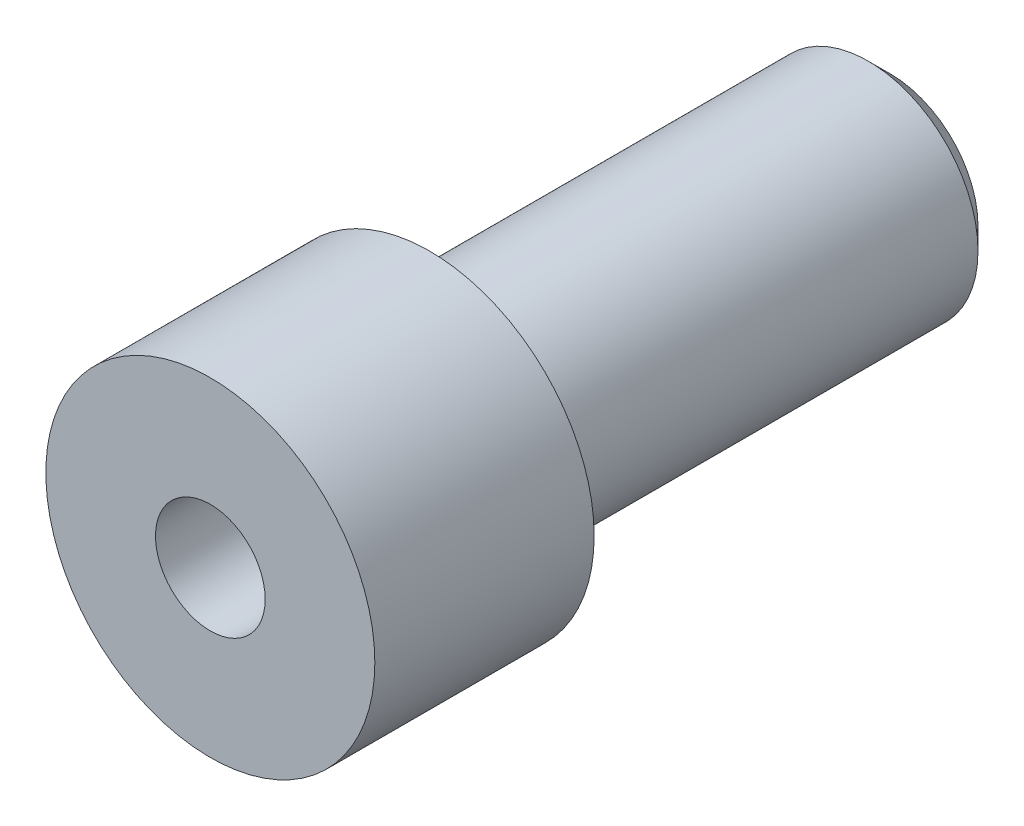
ISO-10303-21;
HEADER;
FILE_DESCRIPTION(('STEP AP214'),'2;1');
FILE_NAME('part.step','',(''),(''),'','','');
FILE_SCHEMA(('AUTOMOTIVE_DESIGN { 1 0 10303 214 1 1 1 1 }'));
ENDSEC;
DATA;
#1=APPLICATION_CONTEXT('core data for automotive mechanical design processes');
#2=APPLICATION_PROTOCOL_DEFINITION('international standard','automotive_design',2000,#1);
#3=PRODUCT_CONTEXT('',#1,'mechanical');
#4=PRODUCT('Part','Part','',(#3));
#5=PRODUCT_RELATED_PRODUCT_CATEGORY('part','',(#4));
#6=PRODUCT_DEFINITION_FORMATION('','',#4);
#7=PRODUCT_DEFINITION_CONTEXT('part definition',#1,'design');
#8=PRODUCT_DEFINITION('design','',#6,#7);
#9=PRODUCT_DEFINITION_SHAPE('','',#8);
#10=(LENGTH_UNIT() NAMED_UNIT(*) SI_UNIT(.MILLI.,.METRE.));
#11=(NAMED_UNIT(*) PLANE_ANGLE_UNIT() SI_UNIT($,.RADIAN.));
#12=(NAMED_UNIT(*) SI_UNIT($,.STERADIAN.) SOLID_ANGLE_UNIT());
#13=UNCERTAINTY_MEASURE_WITH_UNIT(LENGTH_MEASURE(1.E-05),#10,'distance_accuracy_value','');
#14=(GEOMETRIC_REPRESENTATION_CONTEXT(3) GLOBAL_UNCERTAINTY_ASSIGNED_CONTEXT((#13)) GLOBAL_UNIT_ASSIGNED_CONTEXT((#10,
#11,#12)) REPRESENTATION_CONTEXT('',''));
#15=CARTESIAN_POINT('',(0.,0.,0.));
#16=DIRECTION('',(0.,0.,1.));
#17=DIRECTION('',(1.,0.,0.));
#18=AXIS2_PLACEMENT_3D('',#15,#16,#17);
#19=CARTESIAN_POINT('',(0.,0.,2.));
#20=DIRECTION('',(0.,0.,-1.));
#21=DIRECTION('',(-1.,0.,0.));
#22=AXIS2_PLACEMENT_3D('',#19,#20,#21);
#23=CYLINDRICAL_SURFACE('',#22,1.5);
#24=CARTESIAN_POINT('',(0.,0.,2.));
#25=DIRECTION('',(0.,0.,1.));
#26=DIRECTION('',(1.,0.,0.));
#27=AXIS2_PLACEMENT_3D('',#24,#25,#26);
#28=CIRCLE('',#27,1.5);
#29=CARTESIAN_POINT('',(1.5,0.,2.));
#30=VERTEX_POINT('',#29);
#31=EDGE_CURVE('E60',#30,#30,#28,.T.);
#32=ORIENTED_EDGE('',*,*,#31,.F.);
#33=EDGE_LOOP('',(#32));
#34=FACE_BOUND('',#33,.T.);
#35=CARTESIAN_POINT('',(0.,0.,0.));
#36=DIRECTION('',(0.,0.,1.));
#37=DIRECTION('',(1.,0.,0.));
#38=AXIS2_PLACEMENT_3D('',#35,#36,#37);
#39=CIRCLE('',#38,1.5);
#40=CARTESIAN_POINT('',(1.5,0.,0.));
#41=VERTEX_POINT('',#40);
#42=EDGE_CURVE('E56',#41,#41,#39,.T.);
#43=ORIENTED_EDGE('',*,*,#42,.T.);
#44=EDGE_LOOP('',(#43));
#45=FACE_BOUND('',#44,.T.);
#46=ADVANCED_FACE('F36',(#34,#45),#23,.T.);
#47=CARTESIAN_POINT('',(0.,0.,2.));
#48=DIRECTION('',(0.,0.,1.));
#49=DIRECTION('',(1.,0.,0.));
#50=AXIS2_PLACEMENT_3D('',#47,#48,#49);
#51=PLANE('',#50);
#52=CARTESIAN_POINT('',(0.,0.,2.));
#53=DIRECTION('',(0.,0.,1.));
#54=DIRECTION('',(1.,0.,0.));
#55=AXIS2_PLACEMENT_3D('',#52,#53,#54);
#56=CIRCLE('',#55,0.49999999999999);
#57=CARTESIAN_POINT('',(0.49999999999999,0.,2.));
#58=VERTEX_POINT('',#57);
#59=EDGE_CURVE('E57',#58,#58,#56,.T.);
#60=ORIENTED_EDGE('',*,*,#59,.F.);
#61=EDGE_LOOP('',(#60));
#62=FACE_BOUND('',#61,.T.);
#63=ORIENTED_EDGE('',*,*,#31,.T.);
#64=EDGE_LOOP('',(#63));
#65=FACE_BOUND('',#64,.T.);
#66=ADVANCED_FACE('F83',(#62,#65),#51,.T.);
#67=CARTESIAN_POINT('',(0.,0.,0.));
#68=DIRECTION('',(0.,0.,1.));
#69=DIRECTION('',(1.,0.,0.));
#70=AXIS2_PLACEMENT_3D('',#67,#68,#69);
#71=PLANE('',#70);
#72=CARTESIAN_POINT('',(0.,0.,0.));
#73=DIRECTION('',(0.,0.,-1.));
#74=DIRECTION('',(-1.,0.,0.));
#75=AXIS2_PLACEMENT_3D('',#72,#73,#74);
#76=CIRCLE('',#75,1.);
#77=CARTESIAN_POINT('',(-1.,0.,0.));
#78=VERTEX_POINT('',#77);
#79=EDGE_CURVE('E65',#78,#78,#76,.T.);
#80=ORIENTED_EDGE('',*,*,#79,.F.);
#81=EDGE_LOOP('',(#80));
#82=FACE_BOUND('',#81,.T.);
#83=ORIENTED_EDGE('',*,*,#42,.F.);
#84=EDGE_LOOP('',(#83));
#85=FACE_BOUND('',#84,.T.);
#86=ADVANCED_FACE('F88',(#82,#85),#71,.F.);
#87=CARTESIAN_POINT('',(0.,0.,-4.2));
#88=DIRECTION('',(0.,0.,1.));
#89=DIRECTION('',(1.,0.,0.));
#90=AXIS2_PLACEMENT_3D('',#87,#88,#89);
#91=CYLINDRICAL_SURFACE('',#90,1.);
#92=CARTESIAN_POINT('',(0.,0.,-4.));
#93=DIRECTION('',(0.,0.,-1.));
#94=DIRECTION('',(-1.,0.,0.));
#95=AXIS2_PLACEMENT_3D('',#92,#93,#94);
#96=CIRCLE('',#95,1.);
#97=CARTESIAN_POINT('',(-1.,0.,-4.));
#98=VERTEX_POINT('',#97);
#99=EDGE_CURVE('E11',#98,#98,#96,.F.);
#100=ORIENTED_EDGE('',*,*,#99,.T.);
#101=EDGE_LOOP('',(#100));
#102=FACE_BOUND('',#101,.T.);
#103=ORIENTED_EDGE('',*,*,#79,.T.);
#104=EDGE_LOOP('',(#103));
#105=FACE_BOUND('',#104,.T.);
#106=ADVANCED_FACE('F79',(#102,#105),#91,.T.);
#107=CARTESIAN_POINT('',(0.,0.,-4.2));
#108=DIRECTION('',(0.,0.,-1.));
#109=DIRECTION('',(-1.,0.,0.));
#110=AXIS2_PLACEMENT_3D('',#107,#108,#109);
#111=PLANE('',#110);
#112=CARTESIAN_POINT('',(0.,0.,-4.2));
#113=DIRECTION('',(0.,0.,-1.));
#114=DIRECTION('',(-1.,0.,0.));
#115=AXIS2_PLACEMENT_3D('',#112,#113,#114);
#116=CIRCLE('',#115,0.800000000000001);
#117=CARTESIAN_POINT('',(-0.800000000000001,0.,-4.2));
#118=VERTEX_POINT('',#117);
#119=EDGE_CURVE('E44',#118,#118,#116,.T.);
#120=ORIENTED_EDGE('',*,*,#119,.T.);
#121=EDGE_LOOP('',(#120));
#122=FACE_BOUND('',#121,.T.);
#123=ADVANCED_FACE('F72',(#122),#111,.T.);
#124=CARTESIAN_POINT('',(0.,0.,-4.2));
#125=DIRECTION('',(0.,0.,1.));
#126=DIRECTION('',(1.,0.,0.));
#127=AXIS2_PLACEMENT_3D('',#124,#125,#126);
#128=CONICAL_SURFACE('',#127,0.800000000000001,0.785398163397448);
#129=ORIENTED_EDGE('',*,*,#99,.F.);
#130=EDGE_LOOP('',(#129));
#131=FACE_BOUND('',#130,.T.);
#132=ORIENTED_EDGE('',*,*,#119,.F.);
#133=EDGE_LOOP('',(#132));
#134=FACE_BOUND('',#133,.T.);
#135=ADVANCED_FACE('F39',(#131,#134),#128,.T.);
#136=CARTESIAN_POINT('',(0.,0.,-3.2));
#137=DIRECTION('',(0.,0.,1.));
#138=DIRECTION('',(1.,0.,0.));
#139=AXIS2_PLACEMENT_3D('',#136,#137,#138);
#140=CONICAL_SURFACE('',#139,0.499999999999997,1.02974425867665);
#141=CARTESIAN_POINT('',(0.,0.,-3.50043030951378));
#142=VERTEX_POINT('',#141);
#143=VERTEX_LOOP('',#142);
#144=FACE_BOUND('',#143,.T.);
#145=CARTESIAN_POINT('',(0.,0.,-3.2));
#146=DIRECTION('',(0.,0.,1.));
#147=DIRECTION('',(1.,0.,0.));
#148=AXIS2_PLACEMENT_3D('',#145,#146,#147);
#149=CIRCLE('',#148,0.499999999999997);
#150=CARTESIAN_POINT('',(0.499999999999997,0.,-3.2));
#151=VERTEX_POINT('',#150);
#152=EDGE_CURVE('E54',#151,#151,#149,.T.);
#153=ORIENTED_EDGE('',*,*,#152,.T.);
#154=EDGE_LOOP('',(#153));
#155=FACE_BOUND('',#154,.T.);
#156=ADVANCED_FACE('F47',(#144,#155),#140,.F.);
#157=CARTESIAN_POINT('',(0.,0.,2.));
#158=DIRECTION('',(0.,0.,1.));
#159=DIRECTION('',(1.,0.,0.));
#160=AXIS2_PLACEMENT_3D('',#157,#158,#159);
#161=CYLINDRICAL_SURFACE('',#160,0.499999999999994);
#162=ORIENTED_EDGE('',*,*,#152,.F.);
#163=EDGE_LOOP('',(#162));
#164=FACE_BOUND('',#163,.T.);
#165=ORIENTED_EDGE('',*,*,#59,.T.);
#166=EDGE_LOOP('',(#165));
#167=FACE_BOUND('',#166,.T.);
#168=ADVANCED_FACE('F50',(#164,#167),#161,.F.);
#169=CLOSED_SHELL('',(#46,#66,#86,#106,#123,#135,#156,#168));
#170=MANIFOLD_SOLID_BREP('B2',#169);
#171=ADVANCED_BREP_SHAPE_REPRESENTATION('',(#18,#170),#14);
#172=SHAPE_DEFINITION_REPRESENTATION(#9,#171);
ENDSEC;
END-ISO-10303-21;
